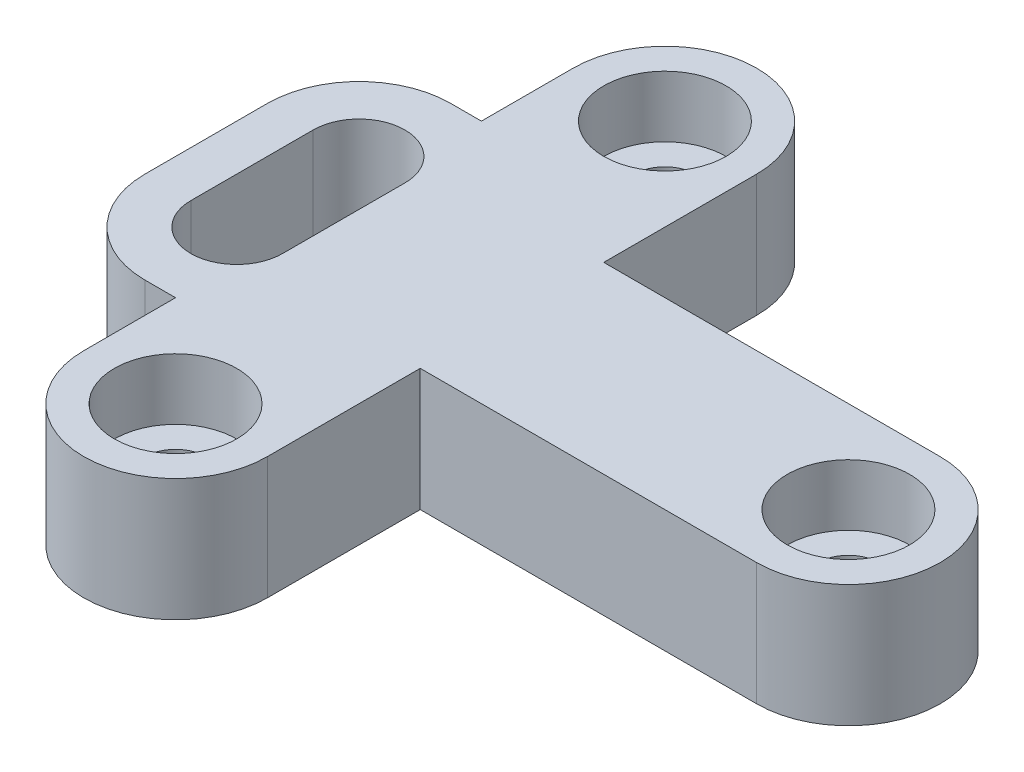
ISO-10303-21;
HEADER;
FILE_DESCRIPTION(('STEP AP214'),'2;1');
FILE_NAME('part.step','',(''),(''),'','','');
FILE_SCHEMA(('AUTOMOTIVE_DESIGN { 1 0 10303 214 1 1 1 1 }'));
ENDSEC;
DATA;
#1=APPLICATION_CONTEXT('core data for automotive mechanical design processes');
#2=APPLICATION_PROTOCOL_DEFINITION('international standard','automotive_design',2000,#1);
#3=PRODUCT_CONTEXT('',#1,'mechanical');
#4=PRODUCT('Part','Part','',(#3));
#5=PRODUCT_RELATED_PRODUCT_CATEGORY('part','',(#4));
#6=PRODUCT_DEFINITION_FORMATION('','',#4);
#7=PRODUCT_DEFINITION_CONTEXT('part definition',#1,'design');
#8=PRODUCT_DEFINITION('design','',#6,#7);
#9=PRODUCT_DEFINITION_SHAPE('','',#8);
#10=(LENGTH_UNIT() NAMED_UNIT(*) SI_UNIT(.MILLI.,.METRE.));
#11=(NAMED_UNIT(*) PLANE_ANGLE_UNIT() SI_UNIT($,.RADIAN.));
#12=(NAMED_UNIT(*) SI_UNIT($,.STERADIAN.) SOLID_ANGLE_UNIT());
#13=UNCERTAINTY_MEASURE_WITH_UNIT(LENGTH_MEASURE(1.E-05),#10,'distance_accuracy_value','');
#14=(GEOMETRIC_REPRESENTATION_CONTEXT(3) GLOBAL_UNCERTAINTY_ASSIGNED_CONTEXT((#13)) GLOBAL_UNIT_ASSIGNED_CONTEXT((#10,
#11,#12)) REPRESENTATION_CONTEXT('',''));
#15=CARTESIAN_POINT('',(0.,0.,0.));
#16=DIRECTION('',(0.,0.,1.));
#17=DIRECTION('',(1.,0.,0.));
#18=AXIS2_PLACEMENT_3D('',#15,#16,#17);
#19=CARTESIAN_POINT('',(20.,10.,30.));
#20=DIRECTION('',(0.,1.,0.));
#21=DIRECTION('',(0.,0.,1.));
#22=AXIS2_PLACEMENT_3D('',#19,#20,#21);
#23=PLANE('',#22);
#24=CARTESIAN_POINT('',(90.,10.,-10.));
#25=DIRECTION('',(0.,1.,0.));
#26=DIRECTION('',(0.,0.,1.));
#27=AXIS2_PLACEMENT_3D('',#24,#25,#26);
#28=CIRCLE('',#27,9.99999999999999);
#29=CARTESIAN_POINT('',(90.,10.,0.));
#30=VERTEX_POINT('',#29);
#31=EDGE_CURVE('E386',#30,#30,#28,.T.);
#32=ORIENTED_EDGE('',*,*,#31,.F.);
#33=EDGE_LOOP('',(#32));
#34=FACE_BOUND('',#33,.T.);
#35=CARTESIAN_POINT('',(20.,10.,-50.));
#36=DIRECTION('',(0.,1.,0.));
#37=DIRECTION('',(0.,0.,1.));
#38=AXIS2_PLACEMENT_3D('',#35,#36,#37);
#39=CIRCLE('',#38,10.);
#40=CARTESIAN_POINT('',(20.,10.,-40.));
#41=VERTEX_POINT('',#40);
#42=EDGE_CURVE('E376',#41,#41,#39,.T.);
#43=ORIENTED_EDGE('',*,*,#42,.F.);
#44=EDGE_LOOP('',(#43));
#45=FACE_BOUND('',#44,.T.);
#46=CARTESIAN_POINT('',(20.,10.,30.));
#47=DIRECTION('',(0.,1.,0.));
#48=DIRECTION('',(0.,0.,1.));
#49=AXIS2_PLACEMENT_3D('',#46,#47,#48);
#50=CIRCLE('',#49,10.);
#51=CARTESIAN_POINT('',(20.,10.,40.));
#52=VERTEX_POINT('',#51);
#53=EDGE_CURVE('E366',#52,#52,#50,.T.);
#54=ORIENTED_EDGE('',*,*,#53,.F.);
#55=EDGE_LOOP('',(#54));
#56=FACE_BOUND('',#55,.T.);
#57=CARTESIAN_POINT('',(20.,10.,30.));
#58=DIRECTION('',(0.,1.,0.));
#59=DIRECTION('',(0.,0.,1.));
#60=AXIS2_PLACEMENT_3D('',#57,#58,#59);
#61=CIRCLE('',#60,15.);
#62=CARTESIAN_POINT('',(5.00000000000001,10.,30.));
#63=VERTEX_POINT('',#62);
#64=CARTESIAN_POINT('',(35.,10.,30.));
#65=VERTEX_POINT('',#64);
#66=EDGE_CURVE('E219',#63,#65,#61,.T.);
#67=ORIENTED_EDGE('',*,*,#66,.T.);
#68=DIRECTION('',(0.,0.,-1.));
#69=VECTOR('',#68,1.);
#70=CARTESIAN_POINT('',(35.,10.,30.));
#71=LINE('',#70,#69);
#72=CARTESIAN_POINT('',(35.,10.,5.00000000000003));
#73=VERTEX_POINT('',#72);
#74=EDGE_CURVE('E223',#65,#73,#71,.T.);
#75=ORIENTED_EDGE('',*,*,#74,.T.);
#76=DIRECTION('',(1.,0.,0.));
#77=VECTOR('',#76,1.);
#78=CARTESIAN_POINT('',(35.,10.,5.00000000000003));
#79=LINE('',#78,#77);
#80=CARTESIAN_POINT('',(89.9999999999999,10.,5.00000000000003));
#81=VERTEX_POINT('',#80);
#82=EDGE_CURVE('E227',#73,#81,#79,.T.);
#83=ORIENTED_EDGE('',*,*,#82,.T.);
#84=CARTESIAN_POINT('',(90.,10.,-10.));
#85=DIRECTION('',(0.,1.,0.));
#86=DIRECTION('',(0.,0.,1.));
#87=AXIS2_PLACEMENT_3D('',#84,#85,#86);
#88=CIRCLE('',#87,15.);
#89=CARTESIAN_POINT('',(90.,10.,-25.));
#90=VERTEX_POINT('',#89);
#91=EDGE_CURVE('E230',#81,#90,#88,.T.);
#92=ORIENTED_EDGE('',*,*,#91,.T.);
#93=DIRECTION('',(-1.,0.,0.));
#94=VECTOR('',#93,1.);
#95=CARTESIAN_POINT('',(35.,10.,-25.));
#96=LINE('',#95,#94);
#97=CARTESIAN_POINT('',(35.,10.,-25.));
#98=VERTEX_POINT('',#97);
#99=EDGE_CURVE('E233',#90,#98,#96,.T.);
#100=ORIENTED_EDGE('',*,*,#99,.T.);
#101=DIRECTION('',(0.,0.,-1.));
#102=VECTOR('',#101,1.);
#103=CARTESIAN_POINT('',(35.,10.,-50.));
#104=LINE('',#103,#102);
#105=CARTESIAN_POINT('',(35.,10.,-50.));
#106=VERTEX_POINT('',#105);
#107=EDGE_CURVE('E236',#98,#106,#104,.T.);
#108=ORIENTED_EDGE('',*,*,#107,.T.);
#109=CARTESIAN_POINT('',(20.,10.,-50.));
#110=DIRECTION('',(0.,1.,0.));
#111=DIRECTION('',(0.,0.,-1.));
#112=AXIS2_PLACEMENT_3D('',#109,#110,#111);
#113=CIRCLE('',#112,15.);
#114=CARTESIAN_POINT('',(5.,10.,-50.));
#115=VERTEX_POINT('',#114);
#116=EDGE_CURVE('E239',#106,#115,#113,.T.);
#117=ORIENTED_EDGE('',*,*,#116,.T.);
#118=DIRECTION('',(0.,0.,1.));
#119=VECTOR('',#118,1.);
#120=CARTESIAN_POINT('',(5.,10.,-50.));
#121=LINE('',#120,#119);
#122=CARTESIAN_POINT('',(5.,10.,-35.));
#123=VERTEX_POINT('',#122);
#124=EDGE_CURVE('E242',#115,#123,#121,.T.);
#125=ORIENTED_EDGE('',*,*,#124,.T.);
#126=DIRECTION('',(-1.,0.,0.));
#127=VECTOR('',#126,1.);
#128=CARTESIAN_POINT('',(5.,10.,-35.));
#129=LINE('',#128,#127);
#130=CARTESIAN_POINT('',(0.,10.,-35.));
#131=VERTEX_POINT('',#130);
#132=EDGE_CURVE('E245',#123,#131,#129,.T.);
#133=ORIENTED_EDGE('',*,*,#132,.T.);
#134=CARTESIAN_POINT('',(0.,10.,-20.));
#135=DIRECTION('',(0.,1.,0.));
#136=DIRECTION('',(0.,0.,1.));
#137=AXIS2_PLACEMENT_3D('',#134,#135,#136);
#138=CIRCLE('',#137,15.);
#139=CARTESIAN_POINT('',(-15.,10.,-20.));
#140=VERTEX_POINT('',#139);
#141=EDGE_CURVE('E248',#131,#140,#138,.T.);
#142=ORIENTED_EDGE('',*,*,#141,.T.);
#143=DIRECTION('',(0.,0.,1.));
#144=VECTOR('',#143,1.);
#145=CARTESIAN_POINT('',(-15.,10.,-20.));
#146=LINE('',#145,#144);
#147=CARTESIAN_POINT('',(-15.,10.,0.));
#148=VERTEX_POINT('',#147);
#149=EDGE_CURVE('E251',#140,#148,#146,.T.);
#150=ORIENTED_EDGE('',*,*,#149,.T.);
#151=CARTESIAN_POINT('',(0.,10.,0.));
#152=DIRECTION('',(0.,1.,0.));
#153=DIRECTION('',(0.,0.,1.));
#154=AXIS2_PLACEMENT_3D('',#151,#152,#153);
#155=CIRCLE('',#154,15.);
#156=CARTESIAN_POINT('',(0.,10.,15.));
#157=VERTEX_POINT('',#156);
#158=EDGE_CURVE('E254',#148,#157,#155,.T.);
#159=ORIENTED_EDGE('',*,*,#158,.T.);
#160=DIRECTION('',(1.,0.,0.));
#161=VECTOR('',#160,1.);
#162=CARTESIAN_POINT('',(5.00000000000001,10.,15.));
#163=LINE('',#162,#161);
#164=CARTESIAN_POINT('',(5.00000000000001,10.,15.));
#165=VERTEX_POINT('',#164);
#166=EDGE_CURVE('E257',#157,#165,#163,.T.);
#167=ORIENTED_EDGE('',*,*,#166,.T.);
#168=DIRECTION('',(0.,0.,1.));
#169=VECTOR('',#168,1.);
#170=CARTESIAN_POINT('',(5.00000000000001,10.,30.));
#171=LINE('',#170,#169);
#172=EDGE_CURVE('E260',#165,#63,#171,.T.);
#173=ORIENTED_EDGE('',*,*,#172,.T.);
#174=EDGE_LOOP('',(#67,#75,#83,#92,#100,#108,#117,#125,#133,#142,#150,#159,#167,#173));
#175=FACE_BOUND('',#174,.T.);
#176=DIRECTION('',(0.,0.,1.));
#177=VECTOR('',#176,1.);
#178=CARTESIAN_POINT('',(-7.49999999999996,10.,-20.));
#179=LINE('',#178,#177);
#180=CARTESIAN_POINT('',(-7.49999999999996,10.,-20.));
#181=VERTEX_POINT('',#180);
#182=CARTESIAN_POINT('',(-7.49999999999999,10.,0.));
#183=VERTEX_POINT('',#182);
#184=EDGE_CURVE('E178',#181,#183,#179,.T.);
#185=ORIENTED_EDGE('',*,*,#184,.F.);
#186=CARTESIAN_POINT('',(0.,10.,-20.));
#187=DIRECTION('',(0.,1.,0.));
#188=DIRECTION('',(0.,0.,1.));
#189=AXIS2_PLACEMENT_3D('',#186,#187,#188);
#190=CIRCLE('',#189,7.49999999999997);
#191=CARTESIAN_POINT('',(7.49999999999997,10.,-20.));
#192=VERTEX_POINT('',#191);
#193=EDGE_CURVE('E169',#192,#181,#190,.T.);
#194=ORIENTED_EDGE('',*,*,#193,.F.);
#195=DIRECTION('',(0.,0.,-1.));
#196=VECTOR('',#195,1.);
#197=CARTESIAN_POINT('',(7.49999999999997,10.,-20.));
#198=LINE('',#197,#196);
#199=CARTESIAN_POINT('',(7.49999999999997,10.,0.));
#200=VERTEX_POINT('',#199);
#201=EDGE_CURVE('E195',#200,#192,#198,.T.);
#202=ORIENTED_EDGE('',*,*,#201,.F.);
#203=CARTESIAN_POINT('',(0.,10.,0.));
#204=DIRECTION('',(0.,1.,0.));
#205=DIRECTION('',(0.,0.,1.));
#206=AXIS2_PLACEMENT_3D('',#203,#204,#205);
#207=CIRCLE('',#206,7.49999999999997);
#208=EDGE_CURVE('E191',#183,#200,#207,.T.);
#209=ORIENTED_EDGE('',*,*,#208,.F.);
#210=EDGE_LOOP('',(#185,#194,#202,#209));
#211=FACE_BOUND('',#210,.T.);
#212=ADVANCED_FACE('F41',(#34,#45,#56,#175,#211),#23,.T.);
#213=CARTESIAN_POINT('',(20.,-10.,30.));
#214=DIRECTION('',(0.,1.,0.));
#215=DIRECTION('',(0.,0.,1.));
#216=AXIS2_PLACEMENT_3D('',#213,#214,#215);
#217=PLANE('',#216);
#218=CARTESIAN_POINT('',(20.,-10.,-50.));
#219=DIRECTION('',(0.,1.,0.));
#220=DIRECTION('',(0.,0.,1.));
#221=AXIS2_PLACEMENT_3D('',#218,#219,#220);
#222=CIRCLE('',#221,5.);
#223=CARTESIAN_POINT('',(20.,-10.,-45.));
#224=VERTEX_POINT('',#223);
#225=EDGE_CURVE('E359',#224,#224,#222,.T.);
#226=ORIENTED_EDGE('',*,*,#225,.T.);
#227=EDGE_LOOP('',(#226));
#228=FACE_BOUND('',#227,.T.);
#229=CARTESIAN_POINT('',(20.,-10.,30.));
#230=DIRECTION('',(0.,1.,0.));
#231=DIRECTION('',(0.,0.,1.));
#232=AXIS2_PLACEMENT_3D('',#229,#230,#231);
#233=CIRCLE('',#232,5.);
#234=CARTESIAN_POINT('',(20.,-10.,35.));
#235=VERTEX_POINT('',#234);
#236=EDGE_CURVE('E397',#235,#235,#233,.T.);
#237=ORIENTED_EDGE('',*,*,#236,.T.);
#238=EDGE_LOOP('',(#237));
#239=FACE_BOUND('',#238,.T.);
#240=CARTESIAN_POINT('',(90.,-10.,-10.));
#241=DIRECTION('',(0.,1.,0.));
#242=DIRECTION('',(0.,0.,1.));
#243=AXIS2_PLACEMENT_3D('',#240,#241,#242);
#244=CIRCLE('',#243,5.);
#245=CARTESIAN_POINT('',(90.,-10.,-5.));
#246=VERTEX_POINT('',#245);
#247=EDGE_CURVE('E393',#246,#246,#244,.T.);
#248=ORIENTED_EDGE('',*,*,#247,.T.);
#249=EDGE_LOOP('',(#248));
#250=FACE_BOUND('',#249,.T.);
#251=CARTESIAN_POINT('',(20.,-10.,30.));
#252=DIRECTION('',(0.,1.,0.));
#253=DIRECTION('',(0.,0.,1.));
#254=AXIS2_PLACEMENT_3D('',#251,#252,#253);
#255=CIRCLE('',#254,15.);
#256=CARTESIAN_POINT('',(5.00000000000001,-10.,30.));
#257=VERTEX_POINT('',#256);
#258=CARTESIAN_POINT('',(35.,-10.,30.));
#259=VERTEX_POINT('',#258);
#260=EDGE_CURVE('E187',#257,#259,#255,.T.);
#261=ORIENTED_EDGE('',*,*,#260,.F.);
#262=DIRECTION('',(0.,0.,1.));
#263=VECTOR('',#262,1.);
#264=CARTESIAN_POINT('',(5.00000000000001,-10.,30.));
#265=LINE('',#264,#263);
#266=CARTESIAN_POINT('',(5.00000000000001,-10.,15.));
#267=VERTEX_POINT('',#266);
#268=EDGE_CURVE('E224',#267,#257,#265,.T.);
#269=ORIENTED_EDGE('',*,*,#268,.F.);
#270=DIRECTION('',(1.,0.,0.));
#271=VECTOR('',#270,1.);
#272=CARTESIAN_POINT('',(5.00000000000001,-10.,15.));
#273=LINE('',#272,#271);
#274=CARTESIAN_POINT('',(0.,-10.,15.));
#275=VERTEX_POINT('',#274);
#276=EDGE_CURVE('E300',#275,#267,#273,.T.);
#277=ORIENTED_EDGE('',*,*,#276,.F.);
#278=CARTESIAN_POINT('',(0.,-10.,0.));
#279=DIRECTION('',(0.,1.,0.));
#280=DIRECTION('',(0.,0.,1.));
#281=AXIS2_PLACEMENT_3D('',#278,#279,#280);
#282=CIRCLE('',#281,15.);
#283=CARTESIAN_POINT('',(-15.,-10.,0.));
#284=VERTEX_POINT('',#283);
#285=EDGE_CURVE('E297',#284,#275,#282,.T.);
#286=ORIENTED_EDGE('',*,*,#285,.F.);
#287=DIRECTION('',(0.,0.,1.));
#288=VECTOR('',#287,1.);
#289=CARTESIAN_POINT('',(-15.,-10.,-20.));
#290=LINE('',#289,#288);
#291=CARTESIAN_POINT('',(-15.,-10.,-20.));
#292=VERTEX_POINT('',#291);
#293=EDGE_CURVE('E294',#292,#284,#290,.T.);
#294=ORIENTED_EDGE('',*,*,#293,.F.);
#295=CARTESIAN_POINT('',(0.,-10.,-20.));
#296=DIRECTION('',(0.,1.,0.));
#297=DIRECTION('',(0.,0.,1.));
#298=AXIS2_PLACEMENT_3D('',#295,#296,#297);
#299=CIRCLE('',#298,15.);
#300=CARTESIAN_POINT('',(0.,-10.,-35.));
#301=VERTEX_POINT('',#300);
#302=EDGE_CURVE('E291',#301,#292,#299,.T.);
#303=ORIENTED_EDGE('',*,*,#302,.F.);
#304=DIRECTION('',(-1.,0.,0.));
#305=VECTOR('',#304,1.);
#306=CARTESIAN_POINT('',(5.,-10.,-35.));
#307=LINE('',#306,#305);
#308=CARTESIAN_POINT('',(5.,-10.,-35.));
#309=VERTEX_POINT('',#308);
#310=EDGE_CURVE('E288',#309,#301,#307,.T.);
#311=ORIENTED_EDGE('',*,*,#310,.F.);
#312=DIRECTION('',(0.,0.,1.));
#313=VECTOR('',#312,1.);
#314=CARTESIAN_POINT('',(5.,-10.,-50.));
#315=LINE('',#314,#313);
#316=CARTESIAN_POINT('',(5.,-10.,-50.));
#317=VERTEX_POINT('',#316);
#318=EDGE_CURVE('E285',#317,#309,#315,.T.);
#319=ORIENTED_EDGE('',*,*,#318,.F.);
#320=CARTESIAN_POINT('',(20.,-10.,-50.));
#321=DIRECTION('',(0.,1.,0.));
#322=DIRECTION('',(0.,0.,-1.));
#323=AXIS2_PLACEMENT_3D('',#320,#321,#322);
#324=CIRCLE('',#323,15.);
#325=CARTESIAN_POINT('',(35.,-10.,-50.));
#326=VERTEX_POINT('',#325);
#327=EDGE_CURVE('E282',#326,#317,#324,.T.);
#328=ORIENTED_EDGE('',*,*,#327,.F.);
#329=DIRECTION('',(0.,0.,-1.));
#330=VECTOR('',#329,1.);
#331=CARTESIAN_POINT('',(35.,-10.,-50.));
#332=LINE('',#331,#330);
#333=CARTESIAN_POINT('',(35.,-10.,-25.));
#334=VERTEX_POINT('',#333);
#335=EDGE_CURVE('E279',#334,#326,#332,.T.);
#336=ORIENTED_EDGE('',*,*,#335,.F.);
#337=DIRECTION('',(-1.,0.,0.));
#338=VECTOR('',#337,1.);
#339=CARTESIAN_POINT('',(35.,-10.,-25.));
#340=LINE('',#339,#338);
#341=CARTESIAN_POINT('',(90.,-10.,-25.));
#342=VERTEX_POINT('',#341);
#343=EDGE_CURVE('E276',#342,#334,#340,.T.);
#344=ORIENTED_EDGE('',*,*,#343,.F.);
#345=CARTESIAN_POINT('',(90.,-10.,-10.));
#346=DIRECTION('',(0.,1.,0.));
#347=DIRECTION('',(0.,0.,1.));
#348=AXIS2_PLACEMENT_3D('',#345,#346,#347);
#349=CIRCLE('',#348,15.);
#350=CARTESIAN_POINT('',(89.9999999999999,-10.,5.00000000000003));
#351=VERTEX_POINT('',#350);
#352=EDGE_CURVE('E273',#351,#342,#349,.T.);
#353=ORIENTED_EDGE('',*,*,#352,.F.);
#354=DIRECTION('',(1.,0.,0.));
#355=VECTOR('',#354,1.);
#356=CARTESIAN_POINT('',(35.,-10.,5.00000000000003));
#357=LINE('',#356,#355);
#358=CARTESIAN_POINT('',(35.,-10.,5.00000000000003));
#359=VERTEX_POINT('',#358);
#360=EDGE_CURVE('E270',#359,#351,#357,.T.);
#361=ORIENTED_EDGE('',*,*,#360,.F.);
#362=DIRECTION('',(0.,0.,-1.));
#363=VECTOR('',#362,1.);
#364=CARTESIAN_POINT('',(35.,-10.,30.));
#365=LINE('',#364,#363);
#366=EDGE_CURVE('E267',#259,#359,#365,.T.);
#367=ORIENTED_EDGE('',*,*,#366,.F.);
#368=EDGE_LOOP('',(#261,#269,#277,#286,#294,#303,#311,#319,#328,#336,#344,#353,#361,#367));
#369=FACE_BOUND('',#368,.T.);
#370=CARTESIAN_POINT('',(0.,-10.,-20.));
#371=DIRECTION('',(0.,1.,0.));
#372=DIRECTION('',(0.,0.,1.));
#373=AXIS2_PLACEMENT_3D('',#370,#371,#372);
#374=CIRCLE('',#373,7.49999999999997);
#375=CARTESIAN_POINT('',(7.49999999999997,-10.,-20.));
#376=VERTEX_POINT('',#375);
#377=CARTESIAN_POINT('',(-7.49999999999996,-10.,-20.));
#378=VERTEX_POINT('',#377);
#379=EDGE_CURVE('E67',#376,#378,#374,.T.);
#380=ORIENTED_EDGE('',*,*,#379,.T.);
#381=DIRECTION('',(0.,0.,1.));
#382=VECTOR('',#381,1.);
#383=CARTESIAN_POINT('',(-7.49999999999996,-10.,-20.));
#384=LINE('',#383,#382);
#385=CARTESIAN_POINT('',(-7.49999999999999,-10.,0.));
#386=VERTEX_POINT('',#385);
#387=EDGE_CURVE('E185',#378,#386,#384,.T.);
#388=ORIENTED_EDGE('',*,*,#387,.T.);
#389=CARTESIAN_POINT('',(0.,-10.,0.));
#390=DIRECTION('',(0.,1.,0.));
#391=DIRECTION('',(0.,0.,1.));
#392=AXIS2_PLACEMENT_3D('',#389,#390,#391);
#393=CIRCLE('',#392,7.49999999999997);
#394=CARTESIAN_POINT('',(7.49999999999997,-10.,0.));
#395=VERTEX_POINT('',#394);
#396=EDGE_CURVE('E206',#386,#395,#393,.T.);
#397=ORIENTED_EDGE('',*,*,#396,.T.);
#398=DIRECTION('',(0.,0.,-1.));
#399=VECTOR('',#398,1.);
#400=CARTESIAN_POINT('',(7.49999999999997,-10.,-20.));
#401=LINE('',#400,#399);
#402=EDGE_CURVE('E179',#395,#376,#401,.T.);
#403=ORIENTED_EDGE('',*,*,#402,.T.);
#404=EDGE_LOOP('',(#380,#388,#397,#403));
#405=FACE_BOUND('',#404,.T.);
#406=ADVANCED_FACE('F405',(#228,#239,#250,#369,#405),#217,.F.);
#407=CARTESIAN_POINT('',(20.,10.,30.));
#408=DIRECTION('',(0.,-1.,0.));
#409=DIRECTION('',(0.,0.,-1.));
#410=AXIS2_PLACEMENT_3D('',#407,#408,#409);
#411=CYLINDRICAL_SURFACE('',#410,15.);
#412=ORIENTED_EDGE('',*,*,#260,.T.);
#413=DIRECTION('',(0.,-1.,0.));
#414=VECTOR('',#413,1.);
#415=CARTESIAN_POINT('',(35.,10.,30.));
#416=LINE('',#415,#414);
#417=EDGE_CURVE('E11',#65,#259,#416,.T.);
#418=ORIENTED_EDGE('',*,*,#417,.F.);
#419=ORIENTED_EDGE('',*,*,#66,.F.);
#420=DIRECTION('',(0.,-1.,0.));
#421=VECTOR('',#420,1.);
#422=CARTESIAN_POINT('',(5.00000000000001,10.,30.));
#423=LINE('',#422,#421);
#424=EDGE_CURVE('E263',#63,#257,#423,.T.);
#425=ORIENTED_EDGE('',*,*,#424,.T.);
#426=EDGE_LOOP('',(#412,#418,#419,#425));
#427=FACE_BOUND('',#426,.T.);
#428=ADVANCED_FACE('F43',(#427),#411,.T.);
#429=CARTESIAN_POINT('',(35.,10.,30.));
#430=DIRECTION('',(-1.,0.,0.));
#431=DIRECTION('',(0.,0.,1.));
#432=AXIS2_PLACEMENT_3D('',#429,#430,#431);
#433=PLANE('',#432);
#434=ORIENTED_EDGE('',*,*,#366,.T.);
#435=DIRECTION('',(0.,-1.,0.));
#436=VECTOR('',#435,1.);
#437=CARTESIAN_POINT('',(35.,10.,5.00000000000003));
#438=LINE('',#437,#436);
#439=EDGE_CURVE('E51',#73,#359,#438,.T.);
#440=ORIENTED_EDGE('',*,*,#439,.F.);
#441=ORIENTED_EDGE('',*,*,#74,.F.);
#442=ORIENTED_EDGE('',*,*,#417,.T.);
#443=EDGE_LOOP('',(#434,#440,#441,#442));
#444=FACE_BOUND('',#443,.T.);
#445=ADVANCED_FACE('F479',(#444),#433,.F.);
#446=CARTESIAN_POINT('',(35.,10.,5.00000000000003));
#447=DIRECTION('',(0.,0.,-1.));
#448=DIRECTION('',(-1.,0.,0.));
#449=AXIS2_PLACEMENT_3D('',#446,#447,#448);
#450=PLANE('',#449);
#451=ORIENTED_EDGE('',*,*,#360,.T.);
#452=DIRECTION('',(0.,-1.,0.));
#453=VECTOR('',#452,1.);
#454=CARTESIAN_POINT('',(89.9999999999999,10.,5.00000000000003));
#455=LINE('',#454,#453);
#456=EDGE_CURVE('E348',#81,#351,#455,.T.);
#457=ORIENTED_EDGE('',*,*,#456,.F.);
#458=ORIENTED_EDGE('',*,*,#82,.F.);
#459=ORIENTED_EDGE('',*,*,#439,.T.);
#460=EDGE_LOOP('',(#451,#457,#458,#459));
#461=FACE_BOUND('',#460,.T.);
#462=ADVANCED_FACE('F476',(#461),#450,.F.);
#463=CARTESIAN_POINT('',(90.,10.,-10.));
#464=DIRECTION('',(0.,-1.,0.));
#465=DIRECTION('',(0.,0.,-1.));
#466=AXIS2_PLACEMENT_3D('',#463,#464,#465);
#467=CYLINDRICAL_SURFACE('',#466,15.);
#468=ORIENTED_EDGE('',*,*,#352,.T.);
#469=DIRECTION('',(0.,-1.,0.));
#470=VECTOR('',#469,1.);
#471=CARTESIAN_POINT('',(90.,10.,-25.));
#472=LINE('',#471,#470);
#473=EDGE_CURVE('E344',#90,#342,#472,.T.);
#474=ORIENTED_EDGE('',*,*,#473,.F.);
#475=ORIENTED_EDGE('',*,*,#91,.F.);
#476=ORIENTED_EDGE('',*,*,#456,.T.);
#477=EDGE_LOOP('',(#468,#474,#475,#476));
#478=FACE_BOUND('',#477,.T.);
#479=ADVANCED_FACE('F472',(#478),#467,.T.);
#480=CARTESIAN_POINT('',(35.,10.,-25.));
#481=DIRECTION('',(0.,0.,1.));
#482=DIRECTION('',(1.,0.,0.));
#483=AXIS2_PLACEMENT_3D('',#480,#481,#482);
#484=PLANE('',#483);
#485=ORIENTED_EDGE('',*,*,#343,.T.);
#486=DIRECTION('',(0.,-1.,0.));
#487=VECTOR('',#486,1.);
#488=CARTESIAN_POINT('',(35.,10.,-25.));
#489=LINE('',#488,#487);
#490=EDGE_CURVE('E340',#98,#334,#489,.T.);
#491=ORIENTED_EDGE('',*,*,#490,.F.);
#492=ORIENTED_EDGE('',*,*,#99,.F.);
#493=ORIENTED_EDGE('',*,*,#473,.T.);
#494=EDGE_LOOP('',(#485,#491,#492,#493));
#495=FACE_BOUND('',#494,.T.);
#496=ADVANCED_FACE('F468',(#495),#484,.F.);
#497=CARTESIAN_POINT('',(35.,10.,-50.));
#498=DIRECTION('',(-1.,0.,0.));
#499=DIRECTION('',(0.,0.,1.));
#500=AXIS2_PLACEMENT_3D('',#497,#498,#499);
#501=PLANE('',#500);
#502=ORIENTED_EDGE('',*,*,#335,.T.);
#503=DIRECTION('',(0.,-1.,0.));
#504=VECTOR('',#503,1.);
#505=CARTESIAN_POINT('',(35.,10.,-50.));
#506=LINE('',#505,#504);
#507=EDGE_CURVE('E336',#106,#326,#506,.T.);
#508=ORIENTED_EDGE('',*,*,#507,.F.);
#509=ORIENTED_EDGE('',*,*,#107,.F.);
#510=ORIENTED_EDGE('',*,*,#490,.T.);
#511=EDGE_LOOP('',(#502,#508,#509,#510));
#512=FACE_BOUND('',#511,.T.);
#513=ADVANCED_FACE('F464',(#512),#501,.F.);
#514=CARTESIAN_POINT('',(20.,10.,-50.));
#515=DIRECTION('',(0.,-1.,0.));
#516=DIRECTION('',(0.,0.,-1.));
#517=AXIS2_PLACEMENT_3D('',#514,#515,#516);
#518=CYLINDRICAL_SURFACE('',#517,15.);
#519=ORIENTED_EDGE('',*,*,#327,.T.);
#520=DIRECTION('',(0.,-1.,0.));
#521=VECTOR('',#520,1.);
#522=CARTESIAN_POINT('',(5.,10.,-50.));
#523=LINE('',#522,#521);
#524=EDGE_CURVE('E332',#115,#317,#523,.T.);
#525=ORIENTED_EDGE('',*,*,#524,.F.);
#526=ORIENTED_EDGE('',*,*,#116,.F.);
#527=ORIENTED_EDGE('',*,*,#507,.T.);
#528=EDGE_LOOP('',(#519,#525,#526,#527));
#529=FACE_BOUND('',#528,.T.);
#530=ADVANCED_FACE('F460',(#529),#518,.T.);
#531=CARTESIAN_POINT('',(5.,10.,-50.));
#532=DIRECTION('',(1.,0.,0.));
#533=DIRECTION('',(0.,0.,-1.));
#534=AXIS2_PLACEMENT_3D('',#531,#532,#533);
#535=PLANE('',#534);
#536=ORIENTED_EDGE('',*,*,#318,.T.);
#537=DIRECTION('',(0.,-1.,0.));
#538=VECTOR('',#537,1.);
#539=CARTESIAN_POINT('',(5.,10.,-35.));
#540=LINE('',#539,#538);
#541=EDGE_CURVE('E328',#123,#309,#540,.T.);
#542=ORIENTED_EDGE('',*,*,#541,.F.);
#543=ORIENTED_EDGE('',*,*,#124,.F.);
#544=ORIENTED_EDGE('',*,*,#524,.T.);
#545=EDGE_LOOP('',(#536,#542,#543,#544));
#546=FACE_BOUND('',#545,.T.);
#547=ADVANCED_FACE('F456',(#546),#535,.F.);
#548=CARTESIAN_POINT('',(5.,10.,-35.));
#549=DIRECTION('',(0.,0.,1.));
#550=DIRECTION('',(1.,0.,0.));
#551=AXIS2_PLACEMENT_3D('',#548,#549,#550);
#552=PLANE('',#551);
#553=ORIENTED_EDGE('',*,*,#310,.T.);
#554=DIRECTION('',(0.,-1.,0.));
#555=VECTOR('',#554,1.);
#556=CARTESIAN_POINT('',(0.,10.,-35.));
#557=LINE('',#556,#555);
#558=EDGE_CURVE('E324',#131,#301,#557,.T.);
#559=ORIENTED_EDGE('',*,*,#558,.F.);
#560=ORIENTED_EDGE('',*,*,#132,.F.);
#561=ORIENTED_EDGE('',*,*,#541,.T.);
#562=EDGE_LOOP('',(#553,#559,#560,#561));
#563=FACE_BOUND('',#562,.T.);
#564=ADVANCED_FACE('F452',(#563),#552,.F.);
#565=CARTESIAN_POINT('',(0.,10.,-20.));
#566=DIRECTION('',(0.,-1.,0.));
#567=DIRECTION('',(0.,0.,-1.));
#568=AXIS2_PLACEMENT_3D('',#565,#566,#567);
#569=CYLINDRICAL_SURFACE('',#568,15.);
#570=ORIENTED_EDGE('',*,*,#302,.T.);
#571=DIRECTION('',(0.,-1.,0.));
#572=VECTOR('',#571,1.);
#573=CARTESIAN_POINT('',(-15.,10.,-20.));
#574=LINE('',#573,#572);
#575=EDGE_CURVE('E320',#140,#292,#574,.T.);
#576=ORIENTED_EDGE('',*,*,#575,.F.);
#577=ORIENTED_EDGE('',*,*,#141,.F.);
#578=ORIENTED_EDGE('',*,*,#558,.T.);
#579=EDGE_LOOP('',(#570,#576,#577,#578));
#580=FACE_BOUND('',#579,.T.);
#581=ADVANCED_FACE('F448',(#580),#569,.T.);
#582=CARTESIAN_POINT('',(-15.,10.,-20.));
#583=DIRECTION('',(1.,0.,0.));
#584=DIRECTION('',(0.,0.,-1.));
#585=AXIS2_PLACEMENT_3D('',#582,#583,#584);
#586=PLANE('',#585);
#587=ORIENTED_EDGE('',*,*,#293,.T.);
#588=DIRECTION('',(0.,-1.,0.));
#589=VECTOR('',#588,1.);
#590=CARTESIAN_POINT('',(-15.,10.,0.));
#591=LINE('',#590,#589);
#592=EDGE_CURVE('E316',#148,#284,#591,.T.);
#593=ORIENTED_EDGE('',*,*,#592,.F.);
#594=ORIENTED_EDGE('',*,*,#149,.F.);
#595=ORIENTED_EDGE('',*,*,#575,.T.);
#596=EDGE_LOOP('',(#587,#593,#594,#595));
#597=FACE_BOUND('',#596,.T.);
#598=ADVANCED_FACE('F444',(#597),#586,.F.);
#599=CARTESIAN_POINT('',(0.,10.,0.));
#600=DIRECTION('',(0.,-1.,0.));
#601=DIRECTION('',(0.,0.,-1.));
#602=AXIS2_PLACEMENT_3D('',#599,#600,#601);
#603=CYLINDRICAL_SURFACE('',#602,15.);
#604=ORIENTED_EDGE('',*,*,#285,.T.);
#605=DIRECTION('',(0.,-1.,0.));
#606=VECTOR('',#605,1.);
#607=CARTESIAN_POINT('',(0.,10.,15.));
#608=LINE('',#607,#606);
#609=EDGE_CURVE('E312',#157,#275,#608,.T.);
#610=ORIENTED_EDGE('',*,*,#609,.F.);
#611=ORIENTED_EDGE('',*,*,#158,.F.);
#612=ORIENTED_EDGE('',*,*,#592,.T.);
#613=EDGE_LOOP('',(#604,#610,#611,#612));
#614=FACE_BOUND('',#613,.T.);
#615=ADVANCED_FACE('F440',(#614),#603,.T.);
#616=CARTESIAN_POINT('',(5.00000000000001,10.,15.));
#617=DIRECTION('',(0.,0.,-1.));
#618=DIRECTION('',(-1.,0.,0.));
#619=AXIS2_PLACEMENT_3D('',#616,#617,#618);
#620=PLANE('',#619);
#621=ORIENTED_EDGE('',*,*,#276,.T.);
#622=DIRECTION('',(0.,-1.,0.));
#623=VECTOR('',#622,1.);
#624=CARTESIAN_POINT('',(5.00000000000001,10.,15.));
#625=LINE('',#624,#623);
#626=EDGE_CURVE('E308',#165,#267,#625,.T.);
#627=ORIENTED_EDGE('',*,*,#626,.F.);
#628=ORIENTED_EDGE('',*,*,#166,.F.);
#629=ORIENTED_EDGE('',*,*,#609,.T.);
#630=EDGE_LOOP('',(#621,#627,#628,#629));
#631=FACE_BOUND('',#630,.T.);
#632=ADVANCED_FACE('F436',(#631),#620,.F.);
#633=CARTESIAN_POINT('',(5.00000000000001,10.,30.));
#634=DIRECTION('',(1.,0.,0.));
#635=DIRECTION('',(0.,0.,-1.));
#636=AXIS2_PLACEMENT_3D('',#633,#634,#635);
#637=PLANE('',#636);
#638=ORIENTED_EDGE('',*,*,#268,.T.);
#639=ORIENTED_EDGE('',*,*,#424,.F.);
#640=ORIENTED_EDGE('',*,*,#172,.F.);
#641=ORIENTED_EDGE('',*,*,#626,.T.);
#642=EDGE_LOOP('',(#638,#639,#640,#641));
#643=FACE_BOUND('',#642,.T.);
#644=ADVANCED_FACE('F433',(#643),#637,.F.);
#645=CARTESIAN_POINT('',(0.,10.,-20.));
#646=DIRECTION('',(0.,-1.,0.));
#647=DIRECTION('',(0.,0.,-1.));
#648=AXIS2_PLACEMENT_3D('',#645,#646,#647);
#649=CYLINDRICAL_SURFACE('',#648,7.49999999999997);
#650=ORIENTED_EDGE('',*,*,#379,.F.);
#651=DIRECTION('',(0.,-1.,0.));
#652=VECTOR('',#651,1.);
#653=CARTESIAN_POINT('',(7.49999999999997,10.,-20.));
#654=LINE('',#653,#652);
#655=EDGE_CURVE('E173',#192,#376,#654,.T.);
#656=ORIENTED_EDGE('',*,*,#655,.F.);
#657=ORIENTED_EDGE('',*,*,#193,.T.);
#658=DIRECTION('',(0.,-1.,0.));
#659=VECTOR('',#658,1.);
#660=CARTESIAN_POINT('',(-7.49999999999996,10.,-20.));
#661=LINE('',#660,#659);
#662=EDGE_CURVE('E172',#181,#378,#661,.T.);
#663=ORIENTED_EDGE('',*,*,#662,.T.);
#664=EDGE_LOOP('',(#650,#656,#657,#663));
#665=FACE_BOUND('',#664,.T.);
#666=ADVANCED_FACE('F171',(#665),#649,.F.);
#667=CARTESIAN_POINT('',(-7.49999999999996,10.,-20.));
#668=DIRECTION('',(1.,0.,0.));
#669=DIRECTION('',(0.,0.,-1.));
#670=AXIS2_PLACEMENT_3D('',#667,#668,#669);
#671=PLANE('',#670);
#672=ORIENTED_EDGE('',*,*,#387,.F.);
#673=ORIENTED_EDGE('',*,*,#662,.F.);
#674=ORIENTED_EDGE('',*,*,#184,.T.);
#675=DIRECTION('',(0.,-1.,0.));
#676=VECTOR('',#675,1.);
#677=CARTESIAN_POINT('',(-7.49999999999999,10.,0.));
#678=LINE('',#677,#676);
#679=EDGE_CURVE('E188',#183,#386,#678,.T.);
#680=ORIENTED_EDGE('',*,*,#679,.T.);
#681=EDGE_LOOP('',(#672,#673,#674,#680));
#682=FACE_BOUND('',#681,.T.);
#683=ADVANCED_FACE('F182',(#682),#671,.T.);
#684=CARTESIAN_POINT('',(0.,10.,0.));
#685=DIRECTION('',(0.,-1.,0.));
#686=DIRECTION('',(0.,0.,-1.));
#687=AXIS2_PLACEMENT_3D('',#684,#685,#686);
#688=CYLINDRICAL_SURFACE('',#687,7.49999999999997);
#689=ORIENTED_EDGE('',*,*,#396,.F.);
#690=ORIENTED_EDGE('',*,*,#679,.F.);
#691=ORIENTED_EDGE('',*,*,#208,.T.);
#692=DIRECTION('',(0.,-1.,0.));
#693=VECTOR('',#692,1.);
#694=CARTESIAN_POINT('',(7.49999999999997,10.,0.));
#695=LINE('',#694,#693);
#696=EDGE_CURVE('E59',#200,#395,#695,.T.);
#697=ORIENTED_EDGE('',*,*,#696,.T.);
#698=EDGE_LOOP('',(#689,#690,#691,#697));
#699=FACE_BOUND('',#698,.T.);
#700=ADVANCED_FACE('F534',(#699),#688,.F.);
#701=CARTESIAN_POINT('',(7.49999999999997,10.,-20.));
#702=DIRECTION('',(-1.,0.,0.));
#703=DIRECTION('',(0.,0.,1.));
#704=AXIS2_PLACEMENT_3D('',#701,#702,#703);
#705=PLANE('',#704);
#706=ORIENTED_EDGE('',*,*,#402,.F.);
#707=ORIENTED_EDGE('',*,*,#696,.F.);
#708=ORIENTED_EDGE('',*,*,#201,.T.);
#709=ORIENTED_EDGE('',*,*,#655,.T.);
#710=EDGE_LOOP('',(#706,#707,#708,#709));
#711=FACE_BOUND('',#710,.T.);
#712=ADVANCED_FACE('F531',(#711),#705,.T.);
#713=CARTESIAN_POINT('',(20.,0.,30.));
#714=DIRECTION('',(0.,1.,0.));
#715=DIRECTION('',(0.,0.,1.));
#716=AXIS2_PLACEMENT_3D('',#713,#714,#715);
#717=CYLINDRICAL_SURFACE('',#716,10.);
#718=CARTESIAN_POINT('',(20.,0.,30.));
#719=DIRECTION('',(0.,1.,0.));
#720=DIRECTION('',(0.,0.,1.));
#721=AXIS2_PLACEMENT_3D('',#718,#719,#720);
#722=CIRCLE('',#721,10.);
#723=CARTESIAN_POINT('',(20.,0.,40.));
#724=VERTEX_POINT('',#723);
#725=EDGE_CURVE('E371',#724,#724,#722,.T.);
#726=ORIENTED_EDGE('',*,*,#725,.F.);
#727=EDGE_LOOP('',(#726));
#728=FACE_BOUND('',#727,.T.);
#729=ORIENTED_EDGE('',*,*,#53,.T.);
#730=EDGE_LOOP('',(#729));
#731=FACE_BOUND('',#730,.T.);
#732=ADVANCED_FACE('F533',(#728,#731),#717,.F.);
#733=CARTESIAN_POINT('',(20.,0.,30.));
#734=DIRECTION('',(0.,1.,0.));
#735=DIRECTION('',(0.,0.,1.));
#736=AXIS2_PLACEMENT_3D('',#733,#734,#735);
#737=PLANE('',#736);
#738=CARTESIAN_POINT('',(20.,0.,30.));
#739=DIRECTION('',(0.,1.,0.));
#740=DIRECTION('',(0.,0.,1.));
#741=AXIS2_PLACEMENT_3D('',#738,#739,#740);
#742=CIRCLE('',#741,5.);
#743=CARTESIAN_POINT('',(20.,0.,35.));
#744=VERTEX_POINT('',#743);
#745=EDGE_CURVE('E45',#744,#744,#742,.T.);
#746=ORIENTED_EDGE('',*,*,#745,.F.);
#747=EDGE_LOOP('',(#746));
#748=FACE_BOUND('',#747,.T.);
#749=ORIENTED_EDGE('',*,*,#725,.T.);
#750=EDGE_LOOP('',(#749));
#751=FACE_BOUND('',#750,.T.);
#752=ADVANCED_FACE('F540',(#748,#751),#737,.T.);
#753=CARTESIAN_POINT('',(20.,0.,-50.));
#754=DIRECTION('',(0.,1.,0.));
#755=DIRECTION('',(0.,0.,1.));
#756=AXIS2_PLACEMENT_3D('',#753,#754,#755);
#757=CYLINDRICAL_SURFACE('',#756,10.);
#758=CARTESIAN_POINT('',(20.,0.,-50.));
#759=DIRECTION('',(0.,1.,0.));
#760=DIRECTION('',(0.,0.,1.));
#761=AXIS2_PLACEMENT_3D('',#758,#759,#760);
#762=CIRCLE('',#761,10.);
#763=CARTESIAN_POINT('',(20.,0.,-40.));
#764=VERTEX_POINT('',#763);
#765=EDGE_CURVE('E382',#764,#764,#762,.T.);
#766=ORIENTED_EDGE('',*,*,#765,.F.);
#767=EDGE_LOOP('',(#766));
#768=FACE_BOUND('',#767,.T.);
#769=ORIENTED_EDGE('',*,*,#42,.T.);
#770=EDGE_LOOP('',(#769));
#771=FACE_BOUND('',#770,.T.);
#772=ADVANCED_FACE('F632',(#768,#771),#757,.F.);
#773=CARTESIAN_POINT('',(20.,0.,-50.));
#774=DIRECTION('',(0.,1.,0.));
#775=DIRECTION('',(0.,0.,1.));
#776=AXIS2_PLACEMENT_3D('',#773,#774,#775);
#777=PLANE('',#776);
#778=CARTESIAN_POINT('',(20.,0.,-50.));
#779=DIRECTION('',(0.,1.,0.));
#780=DIRECTION('',(0.,0.,1.));
#781=AXIS2_PLACEMENT_3D('',#778,#779,#780);
#782=CIRCLE('',#781,5.);
#783=CARTESIAN_POINT('',(20.,0.,-45.));
#784=VERTEX_POINT('',#783);
#785=EDGE_CURVE('E358',#784,#784,#782,.T.);
#786=ORIENTED_EDGE('',*,*,#785,.F.);
#787=EDGE_LOOP('',(#786));
#788=FACE_BOUND('',#787,.T.);
#789=ORIENTED_EDGE('',*,*,#765,.T.);
#790=EDGE_LOOP('',(#789));
#791=FACE_BOUND('',#790,.T.);
#792=ADVANCED_FACE('F640',(#788,#791),#777,.T.);
#793=CARTESIAN_POINT('',(90.,0.,-10.));
#794=DIRECTION('',(0.,1.,0.));
#795=DIRECTION('',(0.,0.,1.));
#796=AXIS2_PLACEMENT_3D('',#793,#794,#795);
#797=CYLINDRICAL_SURFACE('',#796,9.99999999999999);
#798=CARTESIAN_POINT('',(90.,0.,-10.));
#799=DIRECTION('',(0.,1.,0.));
#800=DIRECTION('',(0.,0.,1.));
#801=AXIS2_PLACEMENT_3D('',#798,#799,#800);
#802=CIRCLE('',#801,9.99999999999999);
#803=CARTESIAN_POINT('',(90.,0.,0.));
#804=VERTEX_POINT('',#803);
#805=EDGE_CURVE('E203',#804,#804,#802,.T.);
#806=ORIENTED_EDGE('',*,*,#805,.F.);
#807=EDGE_LOOP('',(#806));
#808=FACE_BOUND('',#807,.T.);
#809=ORIENTED_EDGE('',*,*,#31,.T.);
#810=EDGE_LOOP('',(#809));
#811=FACE_BOUND('',#810,.T.);
#812=ADVANCED_FACE('F623',(#808,#811),#797,.F.);
#813=CARTESIAN_POINT('',(90.,0.,-10.));
#814=DIRECTION('',(0.,1.,0.));
#815=DIRECTION('',(0.,0.,1.));
#816=AXIS2_PLACEMENT_3D('',#813,#814,#815);
#817=PLANE('',#816);
#818=CARTESIAN_POINT('',(90.,0.,-10.));
#819=DIRECTION('',(0.,1.,0.));
#820=DIRECTION('',(0.,0.,1.));
#821=AXIS2_PLACEMENT_3D('',#818,#819,#820);
#822=CIRCLE('',#821,5.);
#823=CARTESIAN_POINT('',(90.,0.,-5.));
#824=VERTEX_POINT('',#823);
#825=EDGE_CURVE('E355',#824,#824,#822,.T.);
#826=ORIENTED_EDGE('',*,*,#825,.F.);
#827=EDGE_LOOP('',(#826));
#828=FACE_BOUND('',#827,.T.);
#829=ORIENTED_EDGE('',*,*,#805,.T.);
#830=EDGE_LOOP('',(#829));
#831=FACE_BOUND('',#830,.T.);
#832=ADVANCED_FACE('F418',(#828,#831),#817,.T.);
#833=CARTESIAN_POINT('',(90.,-10.,-10.));
#834=DIRECTION('',(0.,1.,0.));
#835=DIRECTION('',(0.,0.,1.));
#836=AXIS2_PLACEMENT_3D('',#833,#834,#835);
#837=CYLINDRICAL_SURFACE('',#836,5.);
#838=ORIENTED_EDGE('',*,*,#825,.T.);
#839=EDGE_LOOP('',(#838));
#840=FACE_BOUND('',#839,.T.);
#841=ORIENTED_EDGE('',*,*,#247,.F.);
#842=EDGE_LOOP('',(#841));
#843=FACE_BOUND('',#842,.T.);
#844=ADVANCED_FACE('F411',(#840,#843),#837,.F.);
#845=CARTESIAN_POINT('',(20.,-10.,-50.));
#846=DIRECTION('',(0.,1.,0.));
#847=DIRECTION('',(0.,0.,1.));
#848=AXIS2_PLACEMENT_3D('',#845,#846,#847);
#849=CYLINDRICAL_SURFACE('',#848,5.);
#850=ORIENTED_EDGE('',*,*,#785,.T.);
#851=EDGE_LOOP('',(#850));
#852=FACE_BOUND('',#851,.T.);
#853=ORIENTED_EDGE('',*,*,#225,.F.);
#854=EDGE_LOOP('',(#853));
#855=FACE_BOUND('',#854,.T.);
#856=ADVANCED_FACE('F408',(#852,#855),#849,.F.);
#857=CARTESIAN_POINT('',(20.,-10.,30.));
#858=DIRECTION('',(0.,1.,0.));
#859=DIRECTION('',(0.,0.,1.));
#860=AXIS2_PLACEMENT_3D('',#857,#858,#859);
#861=CYLINDRICAL_SURFACE('',#860,5.);
#862=ORIENTED_EDGE('',*,*,#745,.T.);
#863=EDGE_LOOP('',(#862));
#864=FACE_BOUND('',#863,.T.);
#865=ORIENTED_EDGE('',*,*,#236,.F.);
#866=EDGE_LOOP('',(#865));
#867=FACE_BOUND('',#866,.T.);
#868=ADVANCED_FACE('F410',(#864,#867),#861,.F.);
#869=CLOSED_SHELL('',(#212,#406,#428,#445,#462,#479,#496,#513,#530,#547,#564,#581,#598,#615,
#632,#644,#666,#683,#700,#712,#732,#752,#772,#792,#812,#832,#844,#856,#868));
#870=MANIFOLD_SOLID_BREP('B2',#869);
#871=ADVANCED_BREP_SHAPE_REPRESENTATION('',(#18,#870),#14);
#872=SHAPE_DEFINITION_REPRESENTATION(#9,#871);
ENDSEC;
END-ISO-10303-21;
